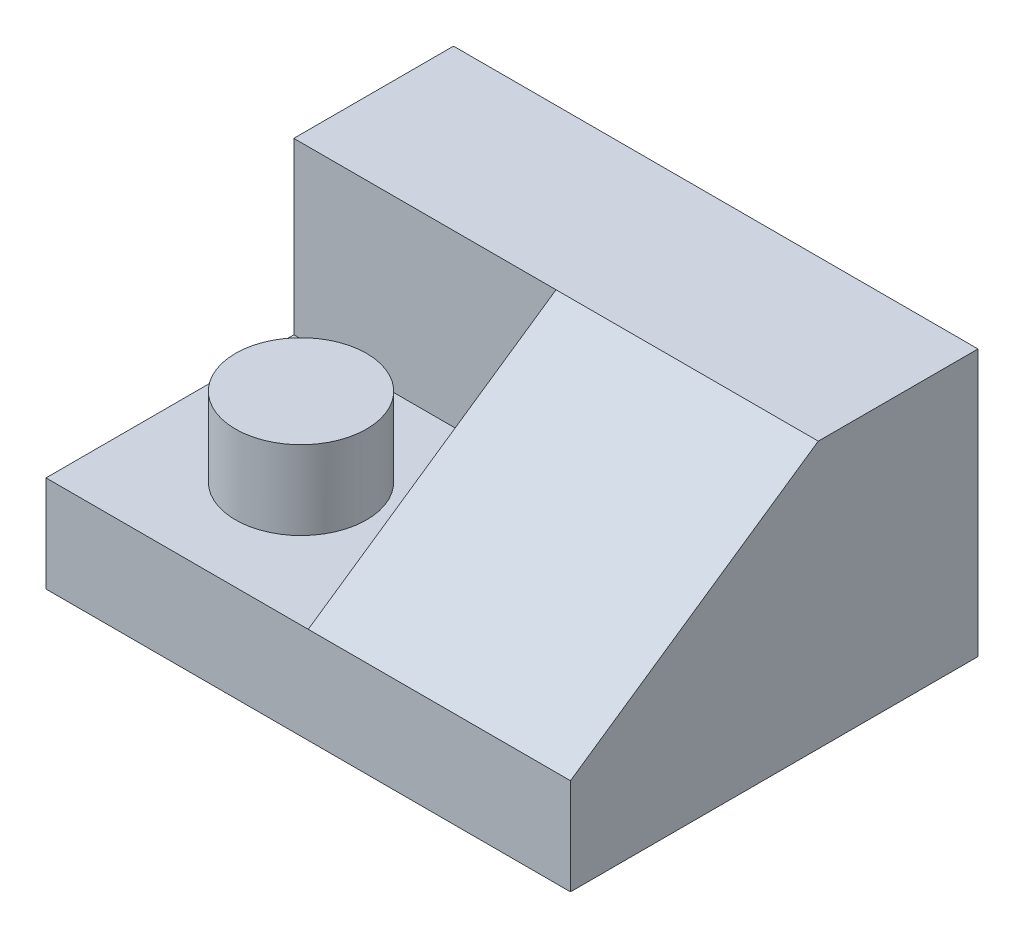
ISO-10303-21;
HEADER;
FILE_DESCRIPTION(('STEP AP214'),'2;1');
FILE_NAME('part.step','',(''),(''),'','','');
FILE_SCHEMA(('AUTOMOTIVE_DESIGN { 1 0 10303 214 1 1 1 1 }'));
ENDSEC;
DATA;
#1=APPLICATION_CONTEXT('core data for automotive mechanical design processes');
#2=APPLICATION_PROTOCOL_DEFINITION('international standard','automotive_design',2000,#1);
#3=PRODUCT_CONTEXT('',#1,'mechanical');
#4=PRODUCT('Part','Part','',(#3));
#5=PRODUCT_RELATED_PRODUCT_CATEGORY('part','',(#4));
#6=PRODUCT_DEFINITION_FORMATION('','',#4);
#7=PRODUCT_DEFINITION_CONTEXT('part definition',#1,'design');
#8=PRODUCT_DEFINITION('design','',#6,#7);
#9=PRODUCT_DEFINITION_SHAPE('','',#8);
#10=(LENGTH_UNIT() NAMED_UNIT(*) SI_UNIT(.MILLI.,.METRE.));
#11=(NAMED_UNIT(*) PLANE_ANGLE_UNIT() SI_UNIT($,.RADIAN.));
#12=(NAMED_UNIT(*) SI_UNIT($,.STERADIAN.) SOLID_ANGLE_UNIT());
#13=UNCERTAINTY_MEASURE_WITH_UNIT(LENGTH_MEASURE(1.E-05),#10,'distance_accuracy_value','');
#14=(GEOMETRIC_REPRESENTATION_CONTEXT(3) GLOBAL_UNCERTAINTY_ASSIGNED_CONTEXT((#13)) GLOBAL_UNIT_ASSIGNED_CONTEXT((#10,
#11,#12)) REPRESENTATION_CONTEXT('',''));
#15=CARTESIAN_POINT('',(0.,0.,0.));
#16=DIRECTION('',(0.,0.,1.));
#17=DIRECTION('',(1.,0.,0.));
#18=AXIS2_PLACEMENT_3D('',#15,#16,#17);
#19=CARTESIAN_POINT('',(50.,18.3567306344543,30.4522508199475));
#20=DIRECTION('',(0.,-1.,0.));
#21=DIRECTION('',(0.,0.,-1.));
#22=AXIS2_PLACEMENT_3D('',#19,#20,#21);
#23=PLANE('',#22);
#24=DIRECTION('',(0.,0.,1.));
#25=VECTOR('',#24,1.);
#26=CARTESIAN_POINT('',(0.,18.3567306344543,30.4522508199475));
#27=LINE('',#26,#25);
#28=CARTESIAN_POINT('',(0.,18.3567306344543,30.4522508199475));
#29=VERTEX_POINT('',#28);
#30=CARTESIAN_POINT('',(0.,18.3567306344543,77.695929662109));
#31=VERTEX_POINT('',#30);
#32=EDGE_CURVE('E141',#29,#31,#27,.T.);
#33=ORIENTED_EDGE('',*,*,#32,.T.);
#34=DIRECTION('',(-1.,0.,0.));
#35=VECTOR('',#34,1.);
#36=CARTESIAN_POINT('',(50.,18.3567306344543,77.695929662109));
#37=LINE('',#36,#35);
#38=CARTESIAN_POINT('',(50.,18.3567306344543,77.695929662109));
#39=VERTEX_POINT('',#38);
#40=EDGE_CURVE('E121',#39,#31,#37,.T.);
#41=ORIENTED_EDGE('',*,*,#40,.F.);
#42=DIRECTION('',(0.,0.,1.));
#43=VECTOR('',#42,1.);
#44=CARTESIAN_POINT('',(50.,18.3567306344543,30.4522508199475));
#45=LINE('',#44,#43);
#46=CARTESIAN_POINT('',(50.,18.3567306344543,30.4522508199475));
#47=VERTEX_POINT('',#46);
#48=EDGE_CURVE('E150',#47,#39,#45,.T.);
#49=ORIENTED_EDGE('',*,*,#48,.F.);
#50=DIRECTION('',(-1.,0.,0.));
#51=VECTOR('',#50,1.);
#52=CARTESIAN_POINT('',(50.,18.3567306344543,30.4522508199475));
#53=LINE('',#52,#51);
#54=EDGE_CURVE('E154',#47,#29,#53,.T.);
#55=ORIENTED_EDGE('',*,*,#54,.T.);
#56=EDGE_LOOP('',(#33,#41,#49,#55));
#57=FACE_BOUND('',#56,.T.);
#58=CARTESIAN_POINT('',(25.,18.3567306344543,54.0740902410283));
#59=DIRECTION('',(0.,-1.,0.));
#60=DIRECTION('',(0.,0.,-1.));
#61=AXIS2_PLACEMENT_3D('',#58,#59,#60);
#62=CIRCLE('',#61,12.5);
#63=CARTESIAN_POINT('',(25.,18.3567306344543,41.5740902410283));
#64=VERTEX_POINT('',#63);
#65=EDGE_CURVE('E11',#64,#64,#62,.F.);
#66=ORIENTED_EDGE('',*,*,#65,.F.);
#67=EDGE_LOOP('',(#66));
#68=FACE_BOUND('',#67,.T.);
#69=ADVANCED_FACE('F33',(#57,#68),#23,.F.);
#70=CARTESIAN_POINT('',(100.,50.8011847790713,30.4522508199475));
#71=DIRECTION('',(0.,-0.824331600923871,-0.56610724400796));
#72=DIRECTION('',(0.,0.56610724400796,-0.824331600923871));
#73=AXIS2_PLACEMENT_3D('',#70,#71,#72);
#74=PLANE('',#73);
#75=DIRECTION('',(0.,0.56610724400796,-0.824331600923871));
#76=VECTOR('',#75,1.);
#77=CARTESIAN_POINT('',(50.,18.3567306344543,77.695929662109));
#78=LINE('',#77,#76);
#79=CARTESIAN_POINT('',(50.,50.8011847790713,30.4522508199475));
#80=VERTEX_POINT('',#79);
#81=EDGE_CURVE('E145',#39,#80,#78,.T.);
#82=ORIENTED_EDGE('',*,*,#81,.F.);
#83=DIRECTION('',(-1.,0.,0.));
#84=VECTOR('',#83,1.);
#85=CARTESIAN_POINT('',(100.,18.3567306344543,77.695929662109));
#86=LINE('',#85,#84);
#87=CARTESIAN_POINT('',(100.,18.3567306344543,77.695929662109));
#88=VERTEX_POINT('',#87);
#89=EDGE_CURVE('E108',#88,#39,#86,.T.);
#90=ORIENTED_EDGE('',*,*,#89,.F.);
#91=DIRECTION('',(0.,-0.56610724400796,0.824331600923871));
#92=VECTOR('',#91,1.);
#93=CARTESIAN_POINT('',(100.,50.8011847790713,30.4522508199475));
#94=LINE('',#93,#92);
#95=CARTESIAN_POINT('',(100.,50.8011847790713,30.4522508199475));
#96=VERTEX_POINT('',#95);
#97=EDGE_CURVE('E95',#96,#88,#94,.T.);
#98=ORIENTED_EDGE('',*,*,#97,.F.);
#99=DIRECTION('',(-1.,0.,0.));
#100=VECTOR('',#99,1.);
#101=CARTESIAN_POINT('',(100.,50.8011847790713,30.4522508199475));
#102=LINE('',#101,#100);
#103=EDGE_CURVE('E101',#96,#80,#102,.T.);
#104=ORIENTED_EDGE('',*,*,#103,.T.);
#105=EDGE_LOOP('',(#82,#90,#98,#104));
#106=FACE_BOUND('',#105,.T.);
#107=ADVANCED_FACE('F110',(#106),#74,.F.);
#108=CARTESIAN_POINT('',(100.,0.,77.695929662109));
#109=DIRECTION('',(0.,1.,0.));
#110=DIRECTION('',(0.,0.,1.));
#111=AXIS2_PLACEMENT_3D('',#108,#109,#110);
#112=PLANE('',#111);
#113=DIRECTION('',(0.,0.,-1.));
#114=VECTOR('',#113,1.);
#115=CARTESIAN_POINT('',(0.,0.,77.695929662109));
#116=LINE('',#115,#114);
#117=CARTESIAN_POINT('',(0.,0.,77.695929662109));
#118=VERTEX_POINT('',#117);
#119=CARTESIAN_POINT('',(0.,0.,0.));
#120=VERTEX_POINT('',#119);
#121=EDGE_CURVE('E117',#118,#120,#116,.T.);
#122=ORIENTED_EDGE('',*,*,#121,.T.);
#123=DIRECTION('',(-1.,0.,0.));
#124=VECTOR('',#123,1.);
#125=CARTESIAN_POINT('',(100.,0.,0.));
#126=LINE('',#125,#124);
#127=CARTESIAN_POINT('',(100.,0.,0.));
#128=VERTEX_POINT('',#127);
#129=EDGE_CURVE('E42',#128,#120,#126,.T.);
#130=ORIENTED_EDGE('',*,*,#129,.F.);
#131=DIRECTION('',(0.,0.,-1.));
#132=VECTOR('',#131,1.);
#133=CARTESIAN_POINT('',(100.,0.,77.695929662109));
#134=LINE('',#133,#132);
#135=CARTESIAN_POINT('',(100.,0.,77.695929662109));
#136=VERTEX_POINT('',#135);
#137=EDGE_CURVE('E126',#136,#128,#134,.T.);
#138=ORIENTED_EDGE('',*,*,#137,.F.);
#139=DIRECTION('',(-1.,0.,0.));
#140=VECTOR('',#139,1.);
#141=CARTESIAN_POINT('',(100.,0.,77.695929662109));
#142=LINE('',#141,#140);
#143=EDGE_CURVE('E113',#136,#118,#142,.T.);
#144=ORIENTED_EDGE('',*,*,#143,.T.);
#145=EDGE_LOOP('',(#122,#130,#138,#144));
#146=FACE_BOUND('',#145,.T.);
#147=ADVANCED_FACE('F35',(#146),#112,.F.);
#148=CARTESIAN_POINT('',(100.,0.,0.));
#149=DIRECTION('',(0.,0.,1.));
#150=DIRECTION('',(1.,0.,0.));
#151=AXIS2_PLACEMENT_3D('',#148,#149,#150);
#152=PLANE('',#151);
#153=DIRECTION('',(0.,1.,0.));
#154=VECTOR('',#153,1.);
#155=CARTESIAN_POINT('',(0.,0.,0.));
#156=LINE('',#155,#154);
#157=CARTESIAN_POINT('',(0.,50.8011847790713,0.));
#158=VERTEX_POINT('',#157);
#159=EDGE_CURVE('E120',#120,#158,#156,.T.);
#160=ORIENTED_EDGE('',*,*,#159,.T.);
#161=DIRECTION('',(-1.,0.,0.));
#162=VECTOR('',#161,1.);
#163=CARTESIAN_POINT('',(100.,50.8011847790713,0.));
#164=LINE('',#163,#162);
#165=CARTESIAN_POINT('',(100.,50.8011847790713,0.));
#166=VERTEX_POINT('',#165);
#167=EDGE_CURVE('E107',#166,#158,#164,.T.);
#168=ORIENTED_EDGE('',*,*,#167,.F.);
#169=DIRECTION('',(0.,1.,0.));
#170=VECTOR('',#169,1.);
#171=CARTESIAN_POINT('',(100.,0.,0.));
#172=LINE('',#171,#170);
#173=EDGE_CURVE('E84',#128,#166,#172,.T.);
#174=ORIENTED_EDGE('',*,*,#173,.F.);
#175=ORIENTED_EDGE('',*,*,#129,.T.);
#176=EDGE_LOOP('',(#160,#168,#174,#175));
#177=FACE_BOUND('',#176,.T.);
#178=ADVANCED_FACE('F130',(#177),#152,.F.);
#179=CARTESIAN_POINT('',(100.,50.8011847790713,0.));
#180=DIRECTION('',(0.,-1.,0.));
#181=DIRECTION('',(0.,0.,-1.));
#182=AXIS2_PLACEMENT_3D('',#179,#180,#181);
#183=PLANE('',#182);
#184=DIRECTION('',(0.,0.,1.));
#185=VECTOR('',#184,1.);
#186=CARTESIAN_POINT('',(0.,50.8011847790713,0.));
#187=LINE('',#186,#185);
#188=CARTESIAN_POINT('',(0.,50.8011847790713,30.4522508199475));
#189=VERTEX_POINT('',#188);
#190=EDGE_CURVE('E123',#158,#189,#187,.T.);
#191=ORIENTED_EDGE('',*,*,#190,.T.);
#192=DIRECTION('',(-1.,0.,0.));
#193=VECTOR('',#192,1.);
#194=CARTESIAN_POINT('',(50.,50.8011847790713,30.4522508199475));
#195=LINE('',#194,#193);
#196=EDGE_CURVE('E68',#80,#189,#195,.T.);
#197=ORIENTED_EDGE('',*,*,#196,.F.);
#198=ORIENTED_EDGE('',*,*,#103,.F.);
#199=DIRECTION('',(0.,0.,1.));
#200=VECTOR('',#199,1.);
#201=CARTESIAN_POINT('',(100.,50.8011847790713,0.));
#202=LINE('',#201,#200);
#203=EDGE_CURVE('E91',#166,#96,#202,.T.);
#204=ORIENTED_EDGE('',*,*,#203,.F.);
#205=ORIENTED_EDGE('',*,*,#167,.T.);
#206=EDGE_LOOP('',(#191,#197,#198,#204,#205));
#207=FACE_BOUND('',#206,.T.);
#208=ADVANCED_FACE('F103',(#207),#183,.F.);
#209=CARTESIAN_POINT('',(100.,18.3567306344543,77.695929662109));
#210=DIRECTION('',(0.,0.,-1.));
#211=DIRECTION('',(-1.,0.,0.));
#212=AXIS2_PLACEMENT_3D('',#209,#210,#211);
#213=PLANE('',#212);
#214=DIRECTION('',(0.,-1.,0.));
#215=VECTOR('',#214,1.);
#216=CARTESIAN_POINT('',(0.,18.3567306344543,77.695929662109));
#217=LINE('',#216,#215);
#218=EDGE_CURVE('E75',#31,#118,#217,.T.);
#219=ORIENTED_EDGE('',*,*,#218,.T.);
#220=ORIENTED_EDGE('',*,*,#143,.F.);
#221=DIRECTION('',(0.,-1.,0.));
#222=VECTOR('',#221,1.);
#223=CARTESIAN_POINT('',(100.,18.3567306344543,77.695929662109));
#224=LINE('',#223,#222);
#225=EDGE_CURVE('E50',#88,#136,#224,.T.);
#226=ORIENTED_EDGE('',*,*,#225,.F.);
#227=ORIENTED_EDGE('',*,*,#89,.T.);
#228=ORIENTED_EDGE('',*,*,#40,.T.);
#229=EDGE_LOOP('',(#219,#220,#226,#227,#228));
#230=FACE_BOUND('',#229,.T.);
#231=ADVANCED_FACE('F170',(#230),#213,.F.);
#232=CARTESIAN_POINT('',(100.,0.,0.));
#233=DIRECTION('',(1.,0.,0.));
#234=DIRECTION('',(0.,0.,-1.));
#235=AXIS2_PLACEMENT_3D('',#232,#233,#234);
#236=PLANE('',#235);
#237=ORIENTED_EDGE('',*,*,#137,.T.);
#238=ORIENTED_EDGE('',*,*,#173,.T.);
#239=ORIENTED_EDGE('',*,*,#203,.T.);
#240=ORIENTED_EDGE('',*,*,#97,.T.);
#241=ORIENTED_EDGE('',*,*,#225,.T.);
#242=EDGE_LOOP('',(#237,#238,#239,#240,#241));
#243=FACE_BOUND('',#242,.T.);
#244=ADVANCED_FACE('F93',(#243),#236,.T.);
#245=CARTESIAN_POINT('',(0.,0.,0.));
#246=DIRECTION('',(1.,0.,0.));
#247=DIRECTION('',(0.,0.,-1.));
#248=AXIS2_PLACEMENT_3D('',#245,#246,#247);
#249=PLANE('',#248);
#250=ORIENTED_EDGE('',*,*,#218,.F.);
#251=ORIENTED_EDGE('',*,*,#32,.F.);
#252=DIRECTION('',(0.,-1.,0.));
#253=VECTOR('',#252,1.);
#254=CARTESIAN_POINT('',(0.,50.8011847790713,30.4522508199475));
#255=LINE('',#254,#253);
#256=EDGE_CURVE('E138',#189,#29,#255,.T.);
#257=ORIENTED_EDGE('',*,*,#256,.F.);
#258=ORIENTED_EDGE('',*,*,#190,.F.);
#259=ORIENTED_EDGE('',*,*,#159,.F.);
#260=ORIENTED_EDGE('',*,*,#121,.F.);
#261=EDGE_LOOP('',(#250,#251,#257,#258,#259,#260));
#262=FACE_BOUND('',#261,.T.);
#263=ADVANCED_FACE('F135',(#262),#249,.F.);
#264=CARTESIAN_POINT('',(50.,50.8011847790713,30.4522508199475));
#265=DIRECTION('',(0.,0.,-1.));
#266=DIRECTION('',(-1.,0.,0.));
#267=AXIS2_PLACEMENT_3D('',#264,#265,#266);
#268=PLANE('',#267);
#269=ORIENTED_EDGE('',*,*,#256,.T.);
#270=ORIENTED_EDGE('',*,*,#54,.F.);
#271=DIRECTION('',(0.,-1.,0.));
#272=VECTOR('',#271,1.);
#273=CARTESIAN_POINT('',(50.,50.8011847790713,30.4522508199475));
#274=LINE('',#273,#272);
#275=EDGE_CURVE('E159',#80,#47,#274,.T.);
#276=ORIENTED_EDGE('',*,*,#275,.F.);
#277=ORIENTED_EDGE('',*,*,#196,.T.);
#278=EDGE_LOOP('',(#269,#270,#276,#277));
#279=FACE_BOUND('',#278,.T.);
#280=ADVANCED_FACE('F173',(#279),#268,.F.);
#281=CARTESIAN_POINT('',(50.,0.,0.));
#282=DIRECTION('',(-1.,0.,0.));
#283=DIRECTION('',(0.,0.,1.));
#284=AXIS2_PLACEMENT_3D('',#281,#282,#283);
#285=PLANE('',#284);
#286=ORIENTED_EDGE('',*,*,#81,.T.);
#287=ORIENTED_EDGE('',*,*,#275,.T.);
#288=ORIENTED_EDGE('',*,*,#48,.T.);
#289=EDGE_LOOP('',(#286,#287,#288));
#290=FACE_BOUND('',#289,.T.);
#291=ADVANCED_FACE('F166',(#290),#285,.T.);
#292=CARTESIAN_POINT('',(25.,33.3567306344543,54.0740902410283));
#293=DIRECTION('',(0.,-1.,0.));
#294=DIRECTION('',(0.,0.,-1.));
#295=AXIS2_PLACEMENT_3D('',#292,#293,#294);
#296=CYLINDRICAL_SURFACE('',#295,12.5);
#297=CARTESIAN_POINT('',(25.,33.3567306344543,54.0740902410283));
#298=DIRECTION('',(0.,1.,0.));
#299=DIRECTION('',(0.,0.,1.));
#300=AXIS2_PLACEMENT_3D('',#297,#298,#299);
#301=CIRCLE('',#300,12.5);
#302=CARTESIAN_POINT('',(25.,33.3567306344543,66.5740902410283));
#303=VERTEX_POINT('',#302);
#304=EDGE_CURVE('E143',#303,#303,#301,.T.);
#305=ORIENTED_EDGE('',*,*,#304,.F.);
#306=EDGE_LOOP('',(#305));
#307=FACE_BOUND('',#306,.T.);
#308=ORIENTED_EDGE('',*,*,#65,.T.);
#309=EDGE_LOOP('',(#308));
#310=FACE_BOUND('',#309,.T.);
#311=ADVANCED_FACE('F181',(#307,#310),#296,.T.);
#312=CARTESIAN_POINT('',(25.,33.3567306344543,54.0740902410283));
#313=DIRECTION('',(0.,1.,0.));
#314=DIRECTION('',(0.,0.,1.));
#315=AXIS2_PLACEMENT_3D('',#312,#313,#314);
#316=PLANE('',#315);
#317=ORIENTED_EDGE('',*,*,#304,.T.);
#318=EDGE_LOOP('',(#317));
#319=FACE_BOUND('',#318,.T.);
#320=ADVANCED_FACE('F196',(#319),#316,.T.);
#321=CLOSED_SHELL('',(#69,#107,#147,#178,#208,#231,#244,#263,#280,#291,#311,#320));
#322=MANIFOLD_SOLID_BREP('B2',#321);
#323=ADVANCED_BREP_SHAPE_REPRESENTATION('',(#18,#322),#14);
#324=SHAPE_DEFINITION_REPRESENTATION(#9,#323);
ENDSEC;
END-ISO-10303-21;
